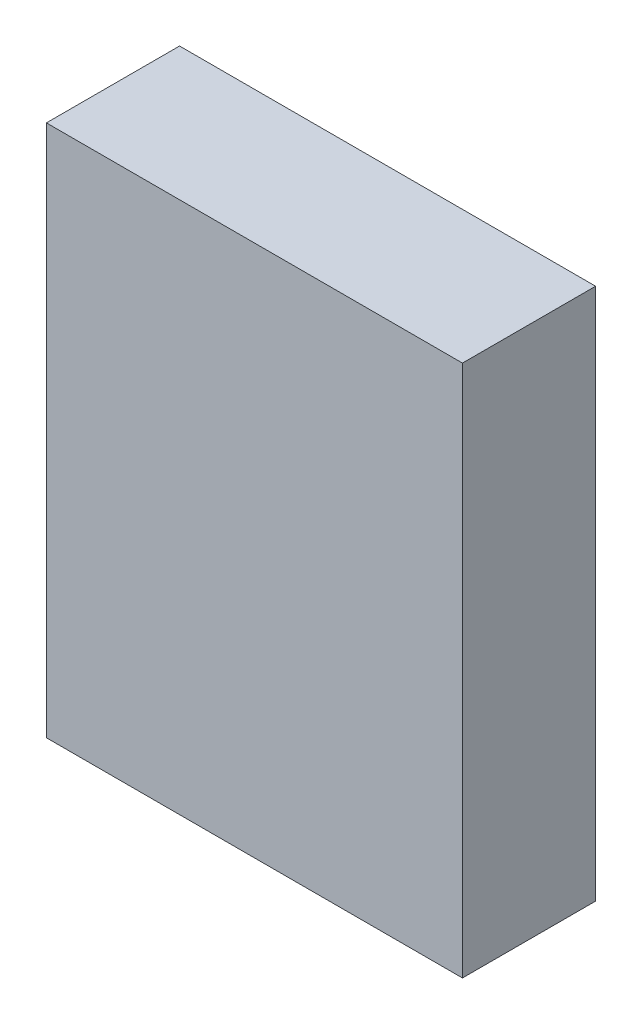
ISO-10303-21;
HEADER;
FILE_DESCRIPTION(('STEP AP214'),'2;1');
FILE_NAME('part.step','',(''),(''),'','','');
FILE_SCHEMA(('AUTOMOTIVE_DESIGN { 1 0 10303 214 1 1 1 1 }'));
ENDSEC;
DATA;
#1=APPLICATION_CONTEXT('core data for automotive mechanical design processes');
#2=APPLICATION_PROTOCOL_DEFINITION('international standard','automotive_design',2000,#1);
#3=PRODUCT_CONTEXT('',#1,'mechanical');
#4=PRODUCT('Part','Part','',(#3));
#5=PRODUCT_RELATED_PRODUCT_CATEGORY('part','',(#4));
#6=PRODUCT_DEFINITION_FORMATION('','',#4);
#7=PRODUCT_DEFINITION_CONTEXT('part definition',#1,'design');
#8=PRODUCT_DEFINITION('design','',#6,#7);
#9=PRODUCT_DEFINITION_SHAPE('','',#8);
#10=(LENGTH_UNIT() NAMED_UNIT(*) SI_UNIT(.MILLI.,.METRE.));
#11=(NAMED_UNIT(*) PLANE_ANGLE_UNIT() SI_UNIT($,.RADIAN.));
#12=(NAMED_UNIT(*) SI_UNIT($,.STERADIAN.) SOLID_ANGLE_UNIT());
#13=UNCERTAINTY_MEASURE_WITH_UNIT(LENGTH_MEASURE(1.E-05),#10,'distance_accuracy_value','');
#14=(GEOMETRIC_REPRESENTATION_CONTEXT(3) GLOBAL_UNCERTAINTY_ASSIGNED_CONTEXT((#13)) GLOBAL_UNIT_ASSIGNED_CONTEXT((#10,
#11,#12)) REPRESENTATION_CONTEXT('',''));
#15=CARTESIAN_POINT('',(0.,0.,0.));
#16=DIRECTION('',(0.,0.,1.));
#17=DIRECTION('',(1.,0.,0.));
#18=AXIS2_PLACEMENT_3D('',#15,#16,#17);
#19=CARTESIAN_POINT('',(1.25000004,-1.59999934,0.80000094));
#20=DIRECTION('',(0.,0.,-1.));
#21=DIRECTION('',(-1.,0.,0.));
#22=AXIS2_PLACEMENT_3D('',#19,#20,#21);
#23=PLANE('',#22);
#24=DIRECTION('',(1.,0.,0.));
#25=VECTOR('',#24,1.);
#26=CARTESIAN_POINT('',(1.25000004,1.59999934,0.80000094));
#27=LINE('',#26,#25);
#28=CARTESIAN_POINT('',(1.25000004,1.59999934,0.80000094));
#29=VERTEX_POINT('',#28);
#30=CARTESIAN_POINT('',(-1.25000004,1.59999934,0.80000094));
#31=VERTEX_POINT('',#30);
#32=EDGE_CURVE('E54',#29,#31,#27,.F.);
#33=ORIENTED_EDGE('',*,*,#32,.T.);
#34=DIRECTION('',(0.,1.,0.));
#35=VECTOR('',#34,1.);
#36=CARTESIAN_POINT('',(-1.25000004,1.59999934,0.80000094));
#37=LINE('',#36,#35);
#38=CARTESIAN_POINT('',(-1.25000004,-1.59999934,0.80000094));
#39=VERTEX_POINT('',#38);
#40=EDGE_CURVE('E56',#31,#39,#37,.F.);
#41=ORIENTED_EDGE('',*,*,#40,.T.);
#42=DIRECTION('',(1.,0.,0.));
#43=VECTOR('',#42,1.);
#44=CARTESIAN_POINT('',(-1.25000004,-1.59999934,0.80000094));
#45=LINE('',#44,#43);
#46=CARTESIAN_POINT('',(1.25000004,-1.59999934,0.80000094));
#47=VERTEX_POINT('',#46);
#48=EDGE_CURVE('E19',#39,#47,#45,.T.);
#49=ORIENTED_EDGE('',*,*,#48,.T.);
#50=DIRECTION('',(0.,1.,0.));
#51=VECTOR('',#50,1.);
#52=CARTESIAN_POINT('',(1.25000004,-1.59999934,0.80000094));
#53=LINE('',#52,#51);
#54=EDGE_CURVE('E79',#47,#29,#53,.T.);
#55=ORIENTED_EDGE('',*,*,#54,.T.);
#56=EDGE_LOOP('',(#33,#41,#49,#55));
#57=FACE_BOUND('',#56,.T.);
#58=ADVANCED_FACE('F16',(#57),#23,.F.);
#59=CARTESIAN_POINT('',(-1.25000004,-1.59999934,0.));
#60=DIRECTION('',(0.,1.,0.));
#61=DIRECTION('',(0.,0.,1.));
#62=AXIS2_PLACEMENT_3D('',#59,#60,#61);
#63=PLANE('',#62);
#64=DIRECTION('',(0.,0.,1.));
#65=VECTOR('',#64,1.);
#66=CARTESIAN_POINT('',(1.25000004,-1.59999934,0.));
#67=LINE('',#66,#65);
#68=CARTESIAN_POINT('',(1.25000004,-1.59999934,0.));
#69=VERTEX_POINT('',#68);
#70=EDGE_CURVE('E67',#69,#47,#67,.T.);
#71=ORIENTED_EDGE('',*,*,#70,.T.);
#72=ORIENTED_EDGE('',*,*,#48,.F.);
#73=DIRECTION('',(0.,0.,-1.));
#74=VECTOR('',#73,1.);
#75=CARTESIAN_POINT('',(-1.25000004,-1.59999934,0.));
#76=LINE('',#75,#74);
#77=CARTESIAN_POINT('',(-1.25000004,-1.59999934,0.));
#78=VERTEX_POINT('',#77);
#79=EDGE_CURVE('E62',#39,#78,#76,.T.);
#80=ORIENTED_EDGE('',*,*,#79,.T.);
#81=DIRECTION('',(-1.,0.,0.));
#82=VECTOR('',#81,1.);
#83=CARTESIAN_POINT('',(1.25000004,-1.59999934,0.));
#84=LINE('',#83,#82);
#85=EDGE_CURVE('E82',#69,#78,#84,.T.);
#86=ORIENTED_EDGE('',*,*,#85,.F.);
#87=EDGE_LOOP('',(#71,#72,#80,#86));
#88=FACE_BOUND('',#87,.T.);
#89=ADVANCED_FACE('F64',(#88),#63,.F.);
#90=CARTESIAN_POINT('',(-1.25000004,1.59999934,0.));
#91=DIRECTION('',(1.,0.,0.));
#92=DIRECTION('',(0.,0.,-1.));
#93=AXIS2_PLACEMENT_3D('',#90,#91,#92);
#94=PLANE('',#93);
#95=ORIENTED_EDGE('',*,*,#79,.F.);
#96=ORIENTED_EDGE('',*,*,#40,.F.);
#97=DIRECTION('',(0.,0.,-1.));
#98=VECTOR('',#97,1.);
#99=CARTESIAN_POINT('',(-1.25000004,1.59999934,0.));
#100=LINE('',#99,#98);
#101=CARTESIAN_POINT('',(-1.25000004,1.59999934,0.));
#102=VERTEX_POINT('',#101);
#103=EDGE_CURVE('E74',#31,#102,#100,.T.);
#104=ORIENTED_EDGE('',*,*,#103,.T.);
#105=DIRECTION('',(0.,1.,0.));
#106=VECTOR('',#105,1.);
#107=CARTESIAN_POINT('',(-1.25000004,-1.59999934,0.));
#108=LINE('',#107,#106);
#109=EDGE_CURVE('E71',#78,#102,#108,.T.);
#110=ORIENTED_EDGE('',*,*,#109,.F.);
#111=EDGE_LOOP('',(#95,#96,#104,#110));
#112=FACE_BOUND('',#111,.T.);
#113=ADVANCED_FACE('F69',(#112),#94,.F.);
#114=CARTESIAN_POINT('',(1.25000004,1.59999934,0.));
#115=DIRECTION('',(0.,-1.,0.));
#116=DIRECTION('',(0.,0.,-1.));
#117=AXIS2_PLACEMENT_3D('',#114,#115,#116);
#118=PLANE('',#117);
#119=ORIENTED_EDGE('',*,*,#103,.F.);
#120=ORIENTED_EDGE('',*,*,#32,.F.);
#121=DIRECTION('',(0.,0.,1.));
#122=VECTOR('',#121,1.);
#123=CARTESIAN_POINT('',(1.25000004,1.59999934,0.));
#124=LINE('',#123,#122);
#125=CARTESIAN_POINT('',(1.25000004,1.59999934,0.));
#126=VERTEX_POINT('',#125);
#127=EDGE_CURVE('E34',#29,#126,#124,.F.);
#128=ORIENTED_EDGE('',*,*,#127,.T.);
#129=DIRECTION('',(-1.,0.,0.));
#130=VECTOR('',#129,1.);
#131=CARTESIAN_POINT('',(1.25000004,1.59999934,0.));
#132=LINE('',#131,#130);
#133=EDGE_CURVE('E25',#102,#126,#132,.F.);
#134=ORIENTED_EDGE('',*,*,#133,.F.);
#135=EDGE_LOOP('',(#119,#120,#128,#134));
#136=FACE_BOUND('',#135,.T.);
#137=ADVANCED_FACE('F88',(#136),#118,.F.);
#138=CARTESIAN_POINT('',(1.25000004,-1.59999934,0.));
#139=DIRECTION('',(-1.,0.,0.));
#140=DIRECTION('',(0.,0.,1.));
#141=AXIS2_PLACEMENT_3D('',#138,#139,#140);
#142=PLANE('',#141);
#143=ORIENTED_EDGE('',*,*,#127,.F.);
#144=ORIENTED_EDGE('',*,*,#54,.F.);
#145=ORIENTED_EDGE('',*,*,#70,.F.);
#146=DIRECTION('',(0.,1.,0.));
#147=VECTOR('',#146,1.);
#148=CARTESIAN_POINT('',(1.25000004,-1.59999934,0.));
#149=LINE('',#148,#147);
#150=EDGE_CURVE('E11',#126,#69,#149,.F.);
#151=ORIENTED_EDGE('',*,*,#150,.F.);
#152=EDGE_LOOP('',(#143,#144,#145,#151));
#153=FACE_BOUND('',#152,.T.);
#154=ADVANCED_FACE('F90',(#153),#142,.F.);
#155=CARTESIAN_POINT('',(1.25000004,-1.59999934,0.));
#156=DIRECTION('',(0.,0.,-1.));
#157=DIRECTION('',(-1.,0.,0.));
#158=AXIS2_PLACEMENT_3D('',#155,#156,#157);
#159=PLANE('',#158);
#160=ORIENTED_EDGE('',*,*,#133,.T.);
#161=ORIENTED_EDGE('',*,*,#150,.T.);
#162=ORIENTED_EDGE('',*,*,#85,.T.);
#163=ORIENTED_EDGE('',*,*,#109,.T.);
#164=EDGE_LOOP('',(#160,#161,#162,#163));
#165=FACE_BOUND('',#164,.T.);
#166=ADVANCED_FACE('F87',(#165),#159,.T.);
#167=CLOSED_SHELL('',(#58,#89,#113,#137,#154,#166));
#168=MANIFOLD_SOLID_BREP('B1',#167);
#169=ADVANCED_BREP_SHAPE_REPRESENTATION('',(#18,#168),#14);
#170=SHAPE_DEFINITION_REPRESENTATION(#9,#169);
ENDSEC;
END-ISO-10303-21;
